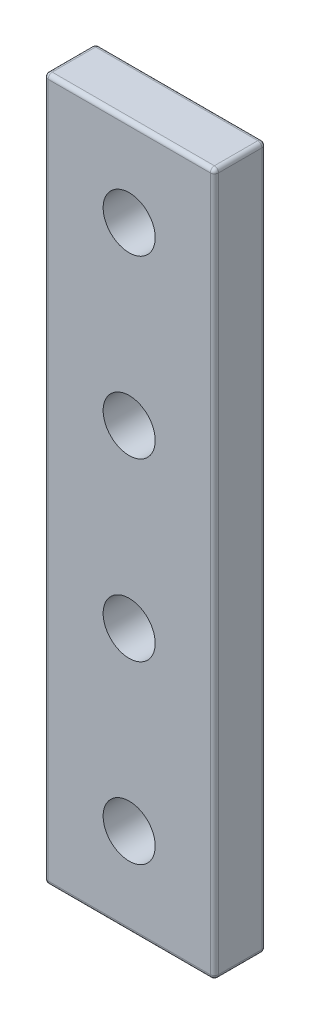
ISO-10303-21;
HEADER;
FILE_DESCRIPTION(('STEP AP214'),'2;1');
FILE_NAME('part.step','',(''),(''),'','','');
FILE_SCHEMA(('AUTOMOTIVE_DESIGN { 1 0 10303 214 1 1 1 1 }'));
ENDSEC;
DATA;
#1=APPLICATION_CONTEXT('core data for automotive mechanical design processes');
#2=APPLICATION_PROTOCOL_DEFINITION('international standard','automotive_design',2000,#1);
#3=PRODUCT_CONTEXT('',#1,'mechanical');
#4=PRODUCT('Part','Part','',(#3));
#5=PRODUCT_RELATED_PRODUCT_CATEGORY('part','',(#4));
#6=PRODUCT_DEFINITION_FORMATION('','',#4);
#7=PRODUCT_DEFINITION_CONTEXT('part definition',#1,'design');
#8=PRODUCT_DEFINITION('design','',#6,#7);
#9=PRODUCT_DEFINITION_SHAPE('','',#8);
#10=(LENGTH_UNIT() NAMED_UNIT(*) SI_UNIT(.MILLI.,.METRE.));
#11=(NAMED_UNIT(*) PLANE_ANGLE_UNIT() SI_UNIT($,.RADIAN.));
#12=(NAMED_UNIT(*) SI_UNIT($,.STERADIAN.) SOLID_ANGLE_UNIT());
#13=UNCERTAINTY_MEASURE_WITH_UNIT(LENGTH_MEASURE(1.E-05),#10,'distance_accuracy_value','');
#14=(GEOMETRIC_REPRESENTATION_CONTEXT(3) GLOBAL_UNCERTAINTY_ASSIGNED_CONTEXT((#13)) GLOBAL_UNIT_ASSIGNED_CONTEXT((#10,
#11,#12)) REPRESENTATION_CONTEXT('',''));
#15=CARTESIAN_POINT('',(0.,0.,0.));
#16=DIRECTION('',(0.,0.,1.));
#17=DIRECTION('',(1.,0.,0.));
#18=AXIS2_PLACEMENT_3D('',#15,#16,#17);
#19=CARTESIAN_POINT('',(5.04802479571278E-11,-1875.57831358665,5.));
#20=DIRECTION('',(0.,1.,0.));
#21=DIRECTION('',(-1.,0.,0.));
#22=AXIS2_PLACEMENT_3D('',#19,#20,#21);
#23=PLANE('',#22);
#24=DIRECTION('',(0.,0.,-1.));
#25=VECTOR('',#24,1.);
#26=CARTESIAN_POINT('',(766.357494380179,-1875.57831358663,0.));
#27=LINE('',#26,#25);
#28=CARTESIAN_POINT('',(766.357494380179,-1875.57831358663,4.6));
#29=VERTEX_POINT('',#28);
#30=CARTESIAN_POINT('',(766.357494380179,-1875.57831358663,0.4));
#31=VERTEX_POINT('',#30);
#32=EDGE_CURVE('E194',#29,#31,#27,.T.);
#33=ORIENTED_EDGE('',*,*,#32,.T.);
#34=DIRECTION('',(1.,0.,0.));
#35=VECTOR('',#34,1.);
#36=CARTESIAN_POINT('',(750.657494380179,-1875.57831358663,0.4));
#37=LINE('',#36,#35);
#38=CARTESIAN_POINT('',(750.657494380179,-1875.57831358663,0.4));
#39=VERTEX_POINT('',#38);
#40=EDGE_CURVE('E11',#31,#39,#37,.F.);
#41=ORIENTED_EDGE('',*,*,#40,.T.);
#42=DIRECTION('',(0.,0.,-1.));
#43=VECTOR('',#42,1.);
#44=CARTESIAN_POINT('',(750.657494380179,-1875.57831358663,5.));
#45=LINE('',#44,#43);
#46=CARTESIAN_POINT('',(750.657494380179,-1875.57831358663,4.6));
#47=VERTEX_POINT('',#46);
#48=EDGE_CURVE('E183',#39,#47,#45,.F.);
#49=ORIENTED_EDGE('',*,*,#48,.T.);
#50=DIRECTION('',(1.,0.,0.));
#51=VECTOR('',#50,1.);
#52=CARTESIAN_POINT('',(5.04802479571278E-11,-1875.57831358665,4.6));
#53=LINE('',#52,#51);
#54=EDGE_CURVE('E197',#47,#29,#53,.T.);
#55=ORIENTED_EDGE('',*,*,#54,.T.);
#56=EDGE_LOOP('',(#33,#41,#49,#55));
#57=FACE_BOUND('',#56,.T.);
#58=ADVANCED_FACE('F49',(#57),#23,.T.);
#59=CARTESIAN_POINT('',(750.257494380179,0.,5.));
#60=DIRECTION('',(-1.,0.,0.));
#61=DIRECTION('',(0.,0.,1.));
#62=AXIS2_PLACEMENT_3D('',#59,#60,#61);
#63=PLANE('',#62);
#64=DIRECTION('',(0.,1.,0.));
#65=VECTOR('',#64,1.);
#66=CARTESIAN_POINT('',(750.257494380179,-1943.57831358663,0.4));
#67=LINE('',#66,#65);
#68=CARTESIAN_POINT('',(750.257494380179,-1875.97831358663,0.4));
#69=VERTEX_POINT('',#68);
#70=CARTESIAN_POINT('',(750.257494380179,-1943.17831358663,0.4));
#71=VERTEX_POINT('',#70);
#72=EDGE_CURVE('E168',#69,#71,#67,.F.);
#73=ORIENTED_EDGE('',*,*,#72,.T.);
#74=DIRECTION('',(0.,0.,-1.));
#75=VECTOR('',#74,1.);
#76=CARTESIAN_POINT('',(750.257494380179,-1943.17831358663,5.));
#77=LINE('',#76,#75);
#78=CARTESIAN_POINT('',(750.257494380179,-1943.17831358663,4.6));
#79=VERTEX_POINT('',#78);
#80=EDGE_CURVE('E166',#71,#79,#77,.F.);
#81=ORIENTED_EDGE('',*,*,#80,.T.);
#82=DIRECTION('',(0.,1.,0.));
#83=VECTOR('',#82,1.);
#84=CARTESIAN_POINT('',(750.257494380179,0.,4.6));
#85=LINE('',#84,#83);
#86=CARTESIAN_POINT('',(750.257494380179,-1875.97831358663,4.6));
#87=VERTEX_POINT('',#86);
#88=EDGE_CURVE('E145',#79,#87,#85,.T.);
#89=ORIENTED_EDGE('',*,*,#88,.T.);
#90=DIRECTION('',(0.,0.,-1.));
#91=VECTOR('',#90,1.);
#92=CARTESIAN_POINT('',(750.257494380179,-1875.97831358663,5.));
#93=LINE('',#92,#91);
#94=EDGE_CURVE('E163',#87,#69,#93,.T.);
#95=ORIENTED_EDGE('',*,*,#94,.T.);
#96=EDGE_LOOP('',(#73,#81,#89,#95));
#97=FACE_BOUND('',#96,.T.);
#98=ADVANCED_FACE('F162',(#97),#63,.T.);
#99=CARTESIAN_POINT('',(2.61552168958306E-11,-1943.57831358664,5.));
#100=DIRECTION('',(0.,1.,0.));
#101=DIRECTION('',(-1.,0.,0.));
#102=AXIS2_PLACEMENT_3D('',#99,#100,#101);
#103=PLANE('',#102);
#104=DIRECTION('',(0.,0.,-1.));
#105=VECTOR('',#104,1.);
#106=CARTESIAN_POINT('',(750.657494380179,-1943.57831358663,0.));
#107=LINE('',#106,#105);
#108=CARTESIAN_POINT('',(750.657494380179,-1943.57831358663,4.6));
#109=VERTEX_POINT('',#108);
#110=CARTESIAN_POINT('',(750.657494380179,-1943.57831358663,0.4));
#111=VERTEX_POINT('',#110);
#112=EDGE_CURVE('E188',#109,#111,#107,.T.);
#113=ORIENTED_EDGE('',*,*,#112,.T.);
#114=DIRECTION('',(1.,0.,0.));
#115=VECTOR('',#114,1.);
#116=CARTESIAN_POINT('',(2.61552168958306E-11,-1943.57831358664,0.4));
#117=LINE('',#116,#115);
#118=CARTESIAN_POINT('',(766.357494380179,-1943.57831358663,0.4));
#119=VERTEX_POINT('',#118);
#120=EDGE_CURVE('E289',#111,#119,#117,.T.);
#121=ORIENTED_EDGE('',*,*,#120,.T.);
#122=DIRECTION('',(0.,0.,-1.));
#123=VECTOR('',#122,1.);
#124=CARTESIAN_POINT('',(766.357494380179,-1943.57831358663,5.));
#125=LINE('',#124,#123);
#126=CARTESIAN_POINT('',(766.357494380179,-1943.57831358663,4.6));
#127=VERTEX_POINT('',#126);
#128=EDGE_CURVE('E209',#119,#127,#125,.F.);
#129=ORIENTED_EDGE('',*,*,#128,.T.);
#130=DIRECTION('',(1.,0.,0.));
#131=VECTOR('',#130,1.);
#132=CARTESIAN_POINT('',(750.657494380179,-1943.57831358663,4.6));
#133=LINE('',#132,#131);
#134=EDGE_CURVE('E212',#127,#109,#133,.F.);
#135=ORIENTED_EDGE('',*,*,#134,.T.);
#136=EDGE_LOOP('',(#113,#121,#129,#135));
#137=FACE_BOUND('',#136,.T.);
#138=ADVANCED_FACE('F380',(#137),#103,.F.);
#139=CARTESIAN_POINT('',(758.507494380179,-1935.07831358663,5.));
#140=DIRECTION('',(0.,0.,-1.));
#141=DIRECTION('',(-1.,0.,0.));
#142=AXIS2_PLACEMENT_3D('',#139,#140,#141);
#143=CYLINDRICAL_SURFACE('',#142,2.5200000000001);
#144=CARTESIAN_POINT('',(758.507494380179,-1935.07831358663,5.));
#145=DIRECTION('',(0.,0.,1.));
#146=DIRECTION('',(1.,0.,0.));
#147=AXIS2_PLACEMENT_3D('',#144,#145,#146);
#148=CIRCLE('',#147,2.5200000000001);
#149=CARTESIAN_POINT('',(761.027494380179,-1935.07831358663,5.));
#150=VERTEX_POINT('',#149);
#151=EDGE_CURVE('E365',#150,#150,#148,.T.);
#152=ORIENTED_EDGE('',*,*,#151,.T.);
#153=EDGE_LOOP('',(#152));
#154=FACE_BOUND('',#153,.T.);
#155=CARTESIAN_POINT('',(758.507494380179,-1935.07831358663,0.));
#156=DIRECTION('',(0.,0.,1.));
#157=DIRECTION('',(1.,0.,0.));
#158=AXIS2_PLACEMENT_3D('',#155,#156,#157);
#159=CIRCLE('',#158,2.5200000000001);
#160=CARTESIAN_POINT('',(761.027494380179,-1935.07831358663,0.));
#161=VERTEX_POINT('',#160);
#162=EDGE_CURVE('E680',#161,#161,#159,.T.);
#163=ORIENTED_EDGE('',*,*,#162,.F.);
#164=EDGE_LOOP('',(#163));
#165=FACE_BOUND('',#164,.T.);
#166=ADVANCED_FACE('F612',(#154,#165),#143,.F.);
#167=CARTESIAN_POINT('',(758.507494380179,-1901.07831358663,5.));
#168=DIRECTION('',(0.,0.,-1.));
#169=DIRECTION('',(-1.,0.,0.));
#170=AXIS2_PLACEMENT_3D('',#167,#168,#169);
#171=CYLINDRICAL_SURFACE('',#170,2.5200000000001);
#172=CARTESIAN_POINT('',(758.507494380179,-1901.07831358663,5.));
#173=DIRECTION('',(0.,0.,1.));
#174=DIRECTION('',(1.,0.,0.));
#175=AXIS2_PLACEMENT_3D('',#172,#173,#174);
#176=CIRCLE('',#175,2.5200000000001);
#177=CARTESIAN_POINT('',(761.027494380179,-1901.07831358663,5.));
#178=VERTEX_POINT('',#177);
#179=EDGE_CURVE('E696',#178,#178,#176,.F.);
#180=ORIENTED_EDGE('',*,*,#179,.F.);
#181=EDGE_LOOP('',(#180));
#182=FACE_BOUND('',#181,.T.);
#183=CARTESIAN_POINT('',(758.507494380179,-1901.07831358663,0.));
#184=DIRECTION('',(0.,0.,1.));
#185=DIRECTION('',(1.,0.,0.));
#186=AXIS2_PLACEMENT_3D('',#183,#184,#185);
#187=CIRCLE('',#186,2.5200000000001);
#188=CARTESIAN_POINT('',(761.027494380179,-1901.07831358663,0.));
#189=VERTEX_POINT('',#188);
#190=EDGE_CURVE('E683',#189,#189,#187,.F.);
#191=ORIENTED_EDGE('',*,*,#190,.T.);
#192=EDGE_LOOP('',(#191));
#193=FACE_BOUND('',#192,.T.);
#194=ADVANCED_FACE('F603',(#182,#193),#171,.F.);
#195=CARTESIAN_POINT('',(758.507494380179,-1884.07831358663,5.));
#196=DIRECTION('',(0.,0.,-1.));
#197=DIRECTION('',(-1.,0.,0.));
#198=AXIS2_PLACEMENT_3D('',#195,#196,#197);
#199=CYLINDRICAL_SURFACE('',#198,2.5200000000001);
#200=CARTESIAN_POINT('',(758.507494380179,-1884.07831358663,5.));
#201=DIRECTION('',(0.,0.,1.));
#202=DIRECTION('',(1.,0.,0.));
#203=AXIS2_PLACEMENT_3D('',#200,#201,#202);
#204=CIRCLE('',#203,2.5200000000001);
#205=CARTESIAN_POINT('',(761.027494380179,-1884.07831358663,5.));
#206=VERTEX_POINT('',#205);
#207=EDGE_CURVE('E687',#206,#206,#204,.F.);
#208=ORIENTED_EDGE('',*,*,#207,.F.);
#209=EDGE_LOOP('',(#208));
#210=FACE_BOUND('',#209,.T.);
#211=CARTESIAN_POINT('',(758.507494380179,-1884.07831358663,0.));
#212=DIRECTION('',(0.,0.,1.));
#213=DIRECTION('',(1.,0.,0.));
#214=AXIS2_PLACEMENT_3D('',#211,#212,#213);
#215=CIRCLE('',#214,2.5200000000001);
#216=CARTESIAN_POINT('',(761.027494380179,-1884.07831358663,0.));
#217=VERTEX_POINT('',#216);
#218=EDGE_CURVE('E265',#217,#217,#215,.F.);
#219=ORIENTED_EDGE('',*,*,#218,.T.);
#220=EDGE_LOOP('',(#219));
#221=FACE_BOUND('',#220,.T.);
#222=ADVANCED_FACE('F595',(#210,#221),#199,.F.);
#223=CARTESIAN_POINT('',(766.757494380179,0.,5.));
#224=DIRECTION('',(-1.,0.,0.));
#225=DIRECTION('',(0.,0.,1.));
#226=AXIS2_PLACEMENT_3D('',#223,#224,#225);
#227=PLANE('',#226);
#228=DIRECTION('',(0.,0.,-1.));
#229=VECTOR('',#228,1.);
#230=CARTESIAN_POINT('',(766.757494380179,-1875.97831358663,5.));
#231=LINE('',#230,#229);
#232=CARTESIAN_POINT('',(766.757494380179,-1875.97831358663,0.4));
#233=VERTEX_POINT('',#232);
#234=CARTESIAN_POINT('',(766.757494380179,-1875.97831358663,4.6));
#235=VERTEX_POINT('',#234);
#236=EDGE_CURVE('E223',#233,#235,#231,.F.);
#237=ORIENTED_EDGE('',*,*,#236,.T.);
#238=DIRECTION('',(0.,1.,0.));
#239=VECTOR('',#238,1.);
#240=CARTESIAN_POINT('',(766.757494380179,-1943.57831358663,4.6));
#241=LINE('',#240,#239);
#242=CARTESIAN_POINT('',(766.757494380179,-1943.17831358663,4.6));
#243=VERTEX_POINT('',#242);
#244=EDGE_CURVE('E226',#235,#243,#241,.F.);
#245=ORIENTED_EDGE('',*,*,#244,.T.);
#246=DIRECTION('',(0.,0.,-1.));
#247=VECTOR('',#246,1.);
#248=CARTESIAN_POINT('',(766.757494380179,-1943.17831358663,5.));
#249=LINE('',#248,#247);
#250=CARTESIAN_POINT('',(766.757494380179,-1943.17831358663,0.4));
#251=VERTEX_POINT('',#250);
#252=EDGE_CURVE('E215',#243,#251,#249,.T.);
#253=ORIENTED_EDGE('',*,*,#252,.T.);
#254=DIRECTION('',(0.,1.,0.));
#255=VECTOR('',#254,1.);
#256=CARTESIAN_POINT('',(766.757494380179,0.,0.4));
#257=LINE('',#256,#255);
#258=EDGE_CURVE('E219',#251,#233,#257,.T.);
#259=ORIENTED_EDGE('',*,*,#258,.T.);
#260=EDGE_LOOP('',(#237,#245,#253,#259));
#261=FACE_BOUND('',#260,.T.);
#262=ADVANCED_FACE('F322',(#261),#227,.F.);
#263=CARTESIAN_POINT('',(758.507494380179,-1918.07831358663,5.));
#264=DIRECTION('',(0.,0.,-1.));
#265=DIRECTION('',(-1.,0.,0.));
#266=AXIS2_PLACEMENT_3D('',#263,#264,#265);
#267=CYLINDRICAL_SURFACE('',#266,2.5200000000001);
#268=CARTESIAN_POINT('',(758.507494380179,-1918.07831358663,5.));
#269=DIRECTION('',(0.,0.,1.));
#270=DIRECTION('',(1.,0.,0.));
#271=AXIS2_PLACEMENT_3D('',#268,#269,#270);
#272=CIRCLE('',#271,2.5200000000001);
#273=CARTESIAN_POINT('',(761.027494380179,-1918.07831358663,5.));
#274=VERTEX_POINT('',#273);
#275=EDGE_CURVE('E361',#274,#274,#272,.T.);
#276=ORIENTED_EDGE('',*,*,#275,.T.);
#277=EDGE_LOOP('',(#276));
#278=FACE_BOUND('',#277,.T.);
#279=CARTESIAN_POINT('',(758.507494380179,-1918.07831358663,0.));
#280=DIRECTION('',(0.,0.,1.));
#281=DIRECTION('',(1.,0.,0.));
#282=AXIS2_PLACEMENT_3D('',#279,#280,#281);
#283=CIRCLE('',#282,2.5200000000001);
#284=CARTESIAN_POINT('',(761.027494380179,-1918.07831358663,0.));
#285=VERTEX_POINT('',#284);
#286=EDGE_CURVE('E368',#285,#285,#283,.T.);
#287=ORIENTED_EDGE('',*,*,#286,.F.);
#288=EDGE_LOOP('',(#287));
#289=FACE_BOUND('',#288,.T.);
#290=ADVANCED_FACE('F578',(#278,#289),#267,.F.);
#291=CARTESIAN_POINT('',(0.,0.,5.));
#292=DIRECTION('',(0.,0.,1.));
#293=DIRECTION('',(1.,0.,0.));
#294=AXIS2_PLACEMENT_3D('',#291,#292,#293);
#295=PLANE('',#294);
#296=DIRECTION('',(0.,1.,0.));
#297=VECTOR('',#296,1.);
#298=CARTESIAN_POINT('',(766.357494380179,-1875.57831358663,5.));
#299=LINE('',#298,#297);
#300=CARTESIAN_POINT('',(766.357494380179,-1943.17831358663,5.));
#301=VERTEX_POINT('',#300);
#302=CARTESIAN_POINT('',(766.357494380179,-1875.97831358663,5.));
#303=VERTEX_POINT('',#302);
#304=EDGE_CURVE('E200',#301,#303,#299,.T.);
#305=ORIENTED_EDGE('',*,*,#304,.T.);
#306=DIRECTION('',(1.,0.,0.));
#307=VECTOR('',#306,1.);
#308=CARTESIAN_POINT('',(5.04910137561545E-11,-1875.97831358665,5.));
#309=LINE('',#308,#307);
#310=CARTESIAN_POINT('',(750.657494380179,-1875.97831358663,5.));
#311=VERTEX_POINT('',#310);
#312=EDGE_CURVE('E206',#303,#311,#309,.F.);
#313=ORIENTED_EDGE('',*,*,#312,.T.);
#314=DIRECTION('',(0.,1.,0.));
#315=VECTOR('',#314,1.);
#316=CARTESIAN_POINT('',(750.657494380179,0.,5.));
#317=LINE('',#316,#315);
#318=CARTESIAN_POINT('',(750.657494380179,-1943.17831358663,5.));
#319=VERTEX_POINT('',#318);
#320=EDGE_CURVE('E148',#311,#319,#317,.F.);
#321=ORIENTED_EDGE('',*,*,#320,.T.);
#322=DIRECTION('',(1.,0.,0.));
#323=VECTOR('',#322,1.);
#324=CARTESIAN_POINT('',(766.757494380179,-1943.17831358663,5.));
#325=LINE('',#324,#323);
#326=EDGE_CURVE('E203',#319,#301,#325,.T.);
#327=ORIENTED_EDGE('',*,*,#326,.T.);
#328=EDGE_LOOP('',(#305,#313,#321,#327));
#329=FACE_BOUND('',#328,.T.);
#330=ORIENTED_EDGE('',*,*,#207,.T.);
#331=EDGE_LOOP('',(#330));
#332=FACE_BOUND('',#331,.T.);
#333=ORIENTED_EDGE('',*,*,#179,.T.);
#334=EDGE_LOOP('',(#333));
#335=FACE_BOUND('',#334,.T.);
#336=ORIENTED_EDGE('',*,*,#151,.F.);
#337=EDGE_LOOP('',(#336));
#338=FACE_BOUND('',#337,.T.);
#339=ORIENTED_EDGE('',*,*,#275,.F.);
#340=EDGE_LOOP('',(#339));
#341=FACE_BOUND('',#340,.T.);
#342=ADVANCED_FACE('F392',(#329,#332,#335,#338,#341),#295,.T.);
#343=CARTESIAN_POINT('',(0.,0.,0.));
#344=DIRECTION('',(0.,0.,1.));
#345=DIRECTION('',(1.,0.,0.));
#346=AXIS2_PLACEMENT_3D('',#343,#344,#345);
#347=PLANE('',#346);
#348=DIRECTION('',(0.,1.,0.));
#349=VECTOR('',#348,1.);
#350=CARTESIAN_POINT('',(766.357494380179,0.,0.));
#351=LINE('',#350,#349);
#352=CARTESIAN_POINT('',(766.357494380179,-1875.97831358663,0.));
#353=VERTEX_POINT('',#352);
#354=CARTESIAN_POINT('',(766.357494380179,-1943.17831358663,0.));
#355=VERTEX_POINT('',#354);
#356=EDGE_CURVE('E230',#353,#355,#351,.F.);
#357=ORIENTED_EDGE('',*,*,#356,.T.);
#358=DIRECTION('',(1.,0.,0.));
#359=VECTOR('',#358,1.);
#360=CARTESIAN_POINT('',(2.61498339963172E-11,-1943.17831358664,0.));
#361=LINE('',#360,#359);
#362=CARTESIAN_POINT('',(750.657494380179,-1943.17831358663,0.));
#363=VERTEX_POINT('',#362);
#364=EDGE_CURVE('E59',#355,#363,#361,.F.);
#365=ORIENTED_EDGE('',*,*,#364,.T.);
#366=DIRECTION('',(0.,1.,0.));
#367=VECTOR('',#366,1.);
#368=CARTESIAN_POINT('',(750.657494380179,-1875.57831358663,0.));
#369=LINE('',#368,#367);
#370=CARTESIAN_POINT('',(750.657494380179,-1875.97831358663,0.));
#371=VERTEX_POINT('',#370);
#372=EDGE_CURVE('E177',#363,#371,#369,.T.);
#373=ORIENTED_EDGE('',*,*,#372,.T.);
#374=DIRECTION('',(1.,0.,0.));
#375=VECTOR('',#374,1.);
#376=CARTESIAN_POINT('',(766.357494380179,-1875.97831358663,0.));
#377=LINE('',#376,#375);
#378=EDGE_CURVE('E292',#371,#353,#377,.T.);
#379=ORIENTED_EDGE('',*,*,#378,.T.);
#380=EDGE_LOOP('',(#357,#365,#373,#379));
#381=FACE_BOUND('',#380,.T.);
#382=ORIENTED_EDGE('',*,*,#218,.F.);
#383=EDGE_LOOP('',(#382));
#384=FACE_BOUND('',#383,.T.);
#385=ORIENTED_EDGE('',*,*,#190,.F.);
#386=EDGE_LOOP('',(#385));
#387=FACE_BOUND('',#386,.T.);
#388=ORIENTED_EDGE('',*,*,#162,.T.);
#389=EDGE_LOOP('',(#388));
#390=FACE_BOUND('',#389,.T.);
#391=ORIENTED_EDGE('',*,*,#286,.T.);
#392=EDGE_LOOP('',(#391));
#393=FACE_BOUND('',#392,.T.);
#394=ADVANCED_FACE('F356',(#381,#384,#387,#390,#393),#347,.F.);
#395=CARTESIAN_POINT('',(750.657494380179,0.,4.6));
#396=DIRECTION('',(0.,1.,0.));
#397=DIRECTION('',(0.,0.,1.));
#398=AXIS2_PLACEMENT_3D('',#395,#396,#397);
#399=CYLINDRICAL_SURFACE('',#398,0.4);
#400=ORIENTED_EDGE('',*,*,#320,.F.);
#401=CARTESIAN_POINT('',(750.657494380179,-1875.97831358663,4.6));
#402=DIRECTION('',(0.,1.,0.));
#403=DIRECTION('',(0.,0.,1.));
#404=AXIS2_PLACEMENT_3D('',#401,#402,#403);
#405=CIRCLE('',#404,0.4);
#406=EDGE_CURVE('E142',#311,#87,#405,.F.);
#407=ORIENTED_EDGE('',*,*,#406,.T.);
#408=ORIENTED_EDGE('',*,*,#88,.F.);
#409=CARTESIAN_POINT('',(750.657494380179,-1943.17831358663,4.6));
#410=DIRECTION('',(0.,1.,0.));
#411=DIRECTION('',(0.,0.,1.));
#412=AXIS2_PLACEMENT_3D('',#409,#410,#411);
#413=CIRCLE('',#412,0.4);
#414=EDGE_CURVE('E155',#79,#319,#413,.T.);
#415=ORIENTED_EDGE('',*,*,#414,.T.);
#416=EDGE_LOOP('',(#400,#407,#408,#415));
#417=FACE_BOUND('',#416,.T.);
#418=ADVANCED_FACE('F144',(#417),#399,.T.);
#419=CARTESIAN_POINT('',(750.657494380179,-1943.17831358663,5.));
#420=DIRECTION('',(0.,0.,1.));
#421=DIRECTION('',(1.,0.,0.));
#422=AXIS2_PLACEMENT_3D('',#419,#420,#421);
#423=CYLINDRICAL_SURFACE('',#422,0.4);
#424=ORIENTED_EDGE('',*,*,#80,.F.);
#425=CARTESIAN_POINT('',(750.657494380179,-1943.17831358663,0.4));
#426=DIRECTION('',(0.,0.,1.));
#427=DIRECTION('',(1.,0.,0.));
#428=AXIS2_PLACEMENT_3D('',#425,#426,#427);
#429=CIRCLE('',#428,0.4);
#430=EDGE_CURVE('E273',#71,#111,#429,.T.);
#431=ORIENTED_EDGE('',*,*,#430,.T.);
#432=ORIENTED_EDGE('',*,*,#112,.F.);
#433=CARTESIAN_POINT('',(750.657494380179,-1943.17831358663,4.6));
#434=DIRECTION('',(0.,0.,1.));
#435=DIRECTION('',(1.,0.,0.));
#436=AXIS2_PLACEMENT_3D('',#433,#434,#435);
#437=CIRCLE('',#436,0.4);
#438=EDGE_CURVE('E154',#109,#79,#437,.F.);
#439=ORIENTED_EDGE('',*,*,#438,.T.);
#440=EDGE_LOOP('',(#424,#431,#432,#439));
#441=FACE_BOUND('',#440,.T.);
#442=ADVANCED_FACE('F384',(#441),#423,.T.);
#443=CARTESIAN_POINT('',(750.657494380179,-1875.97831358663,5.));
#444=DIRECTION('',(0.,0.,-1.));
#445=DIRECTION('',(-1.,0.,0.));
#446=AXIS2_PLACEMENT_3D('',#443,#444,#445);
#447=CYLINDRICAL_SURFACE('',#446,0.4);
#448=ORIENTED_EDGE('',*,*,#48,.F.);
#449=CARTESIAN_POINT('',(750.657494380179,-1875.97831358663,0.4));
#450=DIRECTION('',(0.,0.,-1.));
#451=DIRECTION('',(-1.,0.,0.));
#452=AXIS2_PLACEMENT_3D('',#449,#450,#451);
#453=CIRCLE('',#452,0.4);
#454=EDGE_CURVE('E175',#39,#69,#453,.F.);
#455=ORIENTED_EDGE('',*,*,#454,.T.);
#456=ORIENTED_EDGE('',*,*,#94,.F.);
#457=CARTESIAN_POINT('',(750.657494380179,-1875.97831358663,4.6));
#458=DIRECTION('',(0.,0.,-1.));
#459=DIRECTION('',(-1.,0.,0.));
#460=AXIS2_PLACEMENT_3D('',#457,#458,#459);
#461=CIRCLE('',#460,0.4);
#462=EDGE_CURVE('E173',#87,#47,#461,.T.);
#463=ORIENTED_EDGE('',*,*,#462,.T.);
#464=EDGE_LOOP('',(#448,#455,#456,#463));
#465=FACE_BOUND('',#464,.T.);
#466=ADVANCED_FACE('F172',(#465),#447,.T.);
#467=CARTESIAN_POINT('',(750.657494380179,0.,0.4));
#468=DIRECTION('',(0.,-1.,0.));
#469=DIRECTION('',(0.,0.,-1.));
#470=AXIS2_PLACEMENT_3D('',#467,#468,#469);
#471=CYLINDRICAL_SURFACE('',#470,0.4);
#472=ORIENTED_EDGE('',*,*,#372,.F.);
#473=CARTESIAN_POINT('',(750.657494380179,-1943.17831358663,0.4));
#474=DIRECTION('',(0.,-1.,0.));
#475=DIRECTION('',(0.,0.,-1.));
#476=AXIS2_PLACEMENT_3D('',#473,#474,#475);
#477=CIRCLE('',#476,0.4);
#478=EDGE_CURVE('E269',#363,#71,#477,.F.);
#479=ORIENTED_EDGE('',*,*,#478,.T.);
#480=ORIENTED_EDGE('',*,*,#72,.F.);
#481=CARTESIAN_POINT('',(750.657494380179,-1875.97831358663,0.4));
#482=DIRECTION('',(0.,-1.,0.));
#483=DIRECTION('',(0.,0.,-1.));
#484=AXIS2_PLACEMENT_3D('',#481,#482,#483);
#485=CIRCLE('',#484,0.4);
#486=EDGE_CURVE('E234',#69,#371,#485,.T.);
#487=ORIENTED_EDGE('',*,*,#486,.T.);
#488=EDGE_LOOP('',(#472,#479,#480,#487));
#489=FACE_BOUND('',#488,.T.);
#490=ADVANCED_FACE('F359',(#489),#471,.T.);
#491=CARTESIAN_POINT('',(750.657494380179,-1943.17831358663,4.6));
#492=DIRECTION('',(0.,0.,1.));
#493=DIRECTION('',(1.,0.,0.));
#494=AXIS2_PLACEMENT_3D('',#491,#492,#493);
#495=SPHERICAL_SURFACE('',#494,0.4);
#496=ORIENTED_EDGE('',*,*,#414,.F.);
#497=ORIENTED_EDGE('',*,*,#438,.F.);
#498=CARTESIAN_POINT('',(750.657494380179,-1943.17831358663,4.6));
#499=DIRECTION('',(1.,0.,0.));
#500=DIRECTION('',(0.,0.,-1.));
#501=AXIS2_PLACEMENT_3D('',#498,#499,#500);
#502=CIRCLE('',#501,0.4);
#503=EDGE_CURVE('E261',#319,#109,#502,.T.);
#504=ORIENTED_EDGE('',*,*,#503,.F.);
#505=EDGE_LOOP('',(#496,#497,#504));
#506=FACE_BOUND('',#505,.T.);
#507=ADVANCED_FACE('F387',(#506),#495,.T.);
#508=CARTESIAN_POINT('',(766.357494380179,-1943.17831358663,5.));
#509=DIRECTION('',(0.,0.,-1.));
#510=DIRECTION('',(-1.,0.,0.));
#511=AXIS2_PLACEMENT_3D('',#508,#509,#510);
#512=CYLINDRICAL_SURFACE('',#511,0.4);
#513=ORIENTED_EDGE('',*,*,#128,.F.);
#514=CARTESIAN_POINT('',(766.357494380179,-1943.17831358663,0.4));
#515=DIRECTION('',(0.,0.,-1.));
#516=DIRECTION('',(-1.,0.,0.));
#517=AXIS2_PLACEMENT_3D('',#514,#515,#516);
#518=CIRCLE('',#517,0.4);
#519=EDGE_CURVE('E282',#119,#251,#518,.F.);
#520=ORIENTED_EDGE('',*,*,#519,.T.);
#521=ORIENTED_EDGE('',*,*,#252,.F.);
#522=CARTESIAN_POINT('',(766.357494380179,-1943.17831358663,4.6));
#523=DIRECTION('',(0.,0.,1.));
#524=DIRECTION('',(1.,0.,0.));
#525=AXIS2_PLACEMENT_3D('',#522,#523,#524);
#526=CIRCLE('',#525,0.4);
#527=EDGE_CURVE('E257',#127,#243,#526,.T.);
#528=ORIENTED_EDGE('',*,*,#527,.F.);
#529=EDGE_LOOP('',(#513,#520,#521,#528));
#530=FACE_BOUND('',#529,.T.);
#531=ADVANCED_FACE('F342',(#530),#512,.T.);
#532=CARTESIAN_POINT('',(2.61498339963172E-11,-1943.17831358664,4.6));
#533=DIRECTION('',(-1.,0.,0.));
#534=DIRECTION('',(0.,-1.,0.));
#535=AXIS2_PLACEMENT_3D('',#532,#533,#534);
#536=CYLINDRICAL_SURFACE('',#535,0.4);
#537=ORIENTED_EDGE('',*,*,#503,.T.);
#538=ORIENTED_EDGE('',*,*,#134,.F.);
#539=CARTESIAN_POINT('',(766.357494380179,-1943.17831358663,4.6));
#540=DIRECTION('',(1.,0.,0.));
#541=DIRECTION('',(0.,0.,-1.));
#542=AXIS2_PLACEMENT_3D('',#539,#540,#541);
#543=CIRCLE('',#542,0.4);
#544=EDGE_CURVE('E253',#301,#127,#543,.T.);
#545=ORIENTED_EDGE('',*,*,#544,.F.);
#546=ORIENTED_EDGE('',*,*,#326,.F.);
#547=EDGE_LOOP('',(#537,#538,#545,#546));
#548=FACE_BOUND('',#547,.T.);
#549=ADVANCED_FACE('F390',(#548),#536,.T.);
#550=CARTESIAN_POINT('',(766.357494380179,0.,0.4));
#551=DIRECTION('',(0.,1.,0.));
#552=DIRECTION('',(0.,0.,1.));
#553=AXIS2_PLACEMENT_3D('',#550,#551,#552);
#554=CYLINDRICAL_SURFACE('',#553,0.4);
#555=ORIENTED_EDGE('',*,*,#258,.F.);
#556=CARTESIAN_POINT('',(766.357494380179,-1943.17831358663,0.4));
#557=DIRECTION('',(0.,1.,0.));
#558=DIRECTION('',(0.,0.,1.));
#559=AXIS2_PLACEMENT_3D('',#556,#557,#558);
#560=CIRCLE('',#559,0.4);
#561=EDGE_CURVE('E279',#251,#355,#560,.T.);
#562=ORIENTED_EDGE('',*,*,#561,.T.);
#563=ORIENTED_EDGE('',*,*,#356,.F.);
#564=CARTESIAN_POINT('',(766.357494380179,-1875.97831358663,0.4));
#565=DIRECTION('',(0.,1.,0.));
#566=DIRECTION('',(0.,0.,1.));
#567=AXIS2_PLACEMENT_3D('',#564,#565,#566);
#568=CIRCLE('',#567,0.4);
#569=EDGE_CURVE('E276',#353,#233,#568,.F.);
#570=ORIENTED_EDGE('',*,*,#569,.T.);
#571=EDGE_LOOP('',(#555,#562,#563,#570));
#572=FACE_BOUND('',#571,.T.);
#573=ADVANCED_FACE('F319',(#572),#554,.T.);
#574=CARTESIAN_POINT('',(766.357494380179,-1943.17831358663,4.6));
#575=DIRECTION('',(0.,-1.,0.));
#576=DIRECTION('',(0.,0.,-1.));
#577=AXIS2_PLACEMENT_3D('',#574,#575,#576);
#578=SPHERICAL_SURFACE('',#577,0.4);
#579=ORIENTED_EDGE('',*,*,#544,.T.);
#580=ORIENTED_EDGE('',*,*,#527,.T.);
#581=CARTESIAN_POINT('',(766.357494380179,-1943.17831358663,4.6));
#582=DIRECTION('',(0.,-1.,0.));
#583=DIRECTION('',(0.,0.,-1.));
#584=AXIS2_PLACEMENT_3D('',#581,#582,#583);
#585=CIRCLE('',#584,0.4);
#586=EDGE_CURVE('E250',#301,#243,#585,.F.);
#587=ORIENTED_EDGE('',*,*,#586,.F.);
#588=EDGE_LOOP('',(#579,#580,#587));
#589=FACE_BOUND('',#588,.T.);
#590=ADVANCED_FACE('F338',(#589),#578,.T.);
#591=CARTESIAN_POINT('',(766.357494380179,-1875.97831358663,5.));
#592=DIRECTION('',(0.,0.,1.));
#593=DIRECTION('',(1.,0.,0.));
#594=AXIS2_PLACEMENT_3D('',#591,#592,#593);
#595=CYLINDRICAL_SURFACE('',#594,0.4);
#596=ORIENTED_EDGE('',*,*,#236,.F.);
#597=CARTESIAN_POINT('',(766.357494380179,-1875.97831358663,0.4));
#598=DIRECTION('',(0.,0.,1.));
#599=DIRECTION('',(1.,0.,0.));
#600=AXIS2_PLACEMENT_3D('',#597,#598,#599);
#601=CIRCLE('',#600,0.4);
#602=EDGE_CURVE('E67',#233,#31,#601,.T.);
#603=ORIENTED_EDGE('',*,*,#602,.T.);
#604=ORIENTED_EDGE('',*,*,#32,.F.);
#605=CARTESIAN_POINT('',(766.357494380179,-1875.97831358663,4.6));
#606=DIRECTION('',(0.,0.,1.));
#607=DIRECTION('',(1.,0.,0.));
#608=AXIS2_PLACEMENT_3D('',#605,#606,#607);
#609=CIRCLE('',#608,0.4);
#610=EDGE_CURVE('E246',#235,#29,#609,.T.);
#611=ORIENTED_EDGE('',*,*,#610,.F.);
#612=EDGE_LOOP('',(#596,#603,#604,#611));
#613=FACE_BOUND('',#612,.T.);
#614=ADVANCED_FACE('F326',(#613),#595,.T.);
#615=CARTESIAN_POINT('',(766.357494380179,0.,4.6));
#616=DIRECTION('',(0.,-1.,0.));
#617=DIRECTION('',(0.,0.,-1.));
#618=AXIS2_PLACEMENT_3D('',#615,#616,#617);
#619=CYLINDRICAL_SURFACE('',#618,0.4);
#620=ORIENTED_EDGE('',*,*,#586,.T.);
#621=ORIENTED_EDGE('',*,*,#244,.F.);
#622=CARTESIAN_POINT('',(766.357494380179,-1875.97831358663,4.6));
#623=DIRECTION('',(0.,1.,0.));
#624=DIRECTION('',(0.,0.,1.));
#625=AXIS2_PLACEMENT_3D('',#622,#623,#624);
#626=CIRCLE('',#625,0.4);
#627=EDGE_CURVE('E242',#303,#235,#626,.T.);
#628=ORIENTED_EDGE('',*,*,#627,.F.);
#629=ORIENTED_EDGE('',*,*,#304,.F.);
#630=EDGE_LOOP('',(#620,#621,#628,#629));
#631=FACE_BOUND('',#630,.T.);
#632=ADVANCED_FACE('F334',(#631),#619,.T.);
#633=CARTESIAN_POINT('',(766.357494380179,-1875.97831358663,4.6));
#634=DIRECTION('',(1.,0.,0.));
#635=DIRECTION('',(0.,0.,-1.));
#636=AXIS2_PLACEMENT_3D('',#633,#634,#635);
#637=SPHERICAL_SURFACE('',#636,0.4);
#638=ORIENTED_EDGE('',*,*,#627,.T.);
#639=ORIENTED_EDGE('',*,*,#610,.T.);
#640=CARTESIAN_POINT('',(766.357494380179,-1875.97831358663,4.6));
#641=DIRECTION('',(1.,0.,0.));
#642=DIRECTION('',(0.,0.,-1.));
#643=AXIS2_PLACEMENT_3D('',#640,#641,#642);
#644=CIRCLE('',#643,0.4);
#645=EDGE_CURVE('E237',#303,#29,#644,.F.);
#646=ORIENTED_EDGE('',*,*,#645,.F.);
#647=EDGE_LOOP('',(#638,#639,#646));
#648=FACE_BOUND('',#647,.T.);
#649=ADVANCED_FACE('F330',(#648),#637,.T.);
#650=CARTESIAN_POINT('',(5.04910137561545E-11,-1875.97831358665,4.6));
#651=DIRECTION('',(1.,0.,0.));
#652=DIRECTION('',(0.,1.,0.));
#653=AXIS2_PLACEMENT_3D('',#650,#651,#652);
#654=CYLINDRICAL_SURFACE('',#653,0.4);
#655=ORIENTED_EDGE('',*,*,#645,.T.);
#656=ORIENTED_EDGE('',*,*,#54,.F.);
#657=CARTESIAN_POINT('',(750.657494380179,-1875.97831358663,4.6));
#658=DIRECTION('',(-1.,0.,0.));
#659=DIRECTION('',(0.,0.,1.));
#660=AXIS2_PLACEMENT_3D('',#657,#658,#659);
#661=CIRCLE('',#660,0.4);
#662=EDGE_CURVE('E180',#311,#47,#661,.T.);
#663=ORIENTED_EDGE('',*,*,#662,.F.);
#664=ORIENTED_EDGE('',*,*,#312,.F.);
#665=EDGE_LOOP('',(#655,#656,#663,#664));
#666=FACE_BOUND('',#665,.T.);
#667=ADVANCED_FACE('F395',(#666),#654,.T.);
#668=CARTESIAN_POINT('',(750.657494380179,-1875.97831358663,4.6));
#669=DIRECTION('',(0.,0.,1.));
#670=DIRECTION('',(1.,0.,0.));
#671=AXIS2_PLACEMENT_3D('',#668,#669,#670);
#672=SPHERICAL_SURFACE('',#671,0.4);
#673=ORIENTED_EDGE('',*,*,#462,.F.);
#674=ORIENTED_EDGE('',*,*,#406,.F.);
#675=ORIENTED_EDGE('',*,*,#662,.T.);
#676=EDGE_LOOP('',(#673,#674,#675));
#677=FACE_BOUND('',#676,.T.);
#678=ADVANCED_FACE('F179',(#677),#672,.T.);
#679=CARTESIAN_POINT('',(766.357494380179,-1943.17831358663,0.4));
#680=DIRECTION('',(0.,0.,1.));
#681=DIRECTION('',(1.,0.,0.));
#682=AXIS2_PLACEMENT_3D('',#679,#680,#681);
#683=SPHERICAL_SURFACE('',#682,0.4);
#684=ORIENTED_EDGE('',*,*,#561,.F.);
#685=ORIENTED_EDGE('',*,*,#519,.F.);
#686=CARTESIAN_POINT('',(766.357494380179,-1943.17831358663,0.4));
#687=DIRECTION('',(-1.,0.,0.));
#688=DIRECTION('',(0.,0.,1.));
#689=AXIS2_PLACEMENT_3D('',#686,#687,#688);
#690=CIRCLE('',#689,0.4);
#691=EDGE_CURVE('E238',#355,#119,#690,.T.);
#692=ORIENTED_EDGE('',*,*,#691,.F.);
#693=EDGE_LOOP('',(#684,#685,#692));
#694=FACE_BOUND('',#693,.T.);
#695=ADVANCED_FACE('F346',(#694),#683,.T.);
#696=CARTESIAN_POINT('',(2.61498339963172E-11,-1943.17831358664,0.4));
#697=DIRECTION('',(1.,0.,0.));
#698=DIRECTION('',(0.,1.,0.));
#699=AXIS2_PLACEMENT_3D('',#696,#697,#698);
#700=CYLINDRICAL_SURFACE('',#699,0.4);
#701=ORIENTED_EDGE('',*,*,#691,.T.);
#702=ORIENTED_EDGE('',*,*,#120,.F.);
#703=CARTESIAN_POINT('',(750.657494380179,-1943.17831358663,0.4));
#704=DIRECTION('',(-1.,0.,0.));
#705=DIRECTION('',(0.,0.,1.));
#706=AXIS2_PLACEMENT_3D('',#703,#704,#705);
#707=CIRCLE('',#706,0.4);
#708=EDGE_CURVE('E297',#363,#111,#707,.T.);
#709=ORIENTED_EDGE('',*,*,#708,.F.);
#710=ORIENTED_EDGE('',*,*,#364,.F.);
#711=EDGE_LOOP('',(#701,#702,#709,#710));
#712=FACE_BOUND('',#711,.T.);
#713=ADVANCED_FACE('F350',(#712),#700,.T.);
#714=CARTESIAN_POINT('',(750.657494380179,-1943.17831358663,0.4));
#715=DIRECTION('',(0.,0.,1.));
#716=DIRECTION('',(1.,0.,0.));
#717=AXIS2_PLACEMENT_3D('',#714,#715,#716);
#718=SPHERICAL_SURFACE('',#717,0.4);
#719=ORIENTED_EDGE('',*,*,#708,.T.);
#720=ORIENTED_EDGE('',*,*,#430,.F.);
#721=ORIENTED_EDGE('',*,*,#478,.F.);
#722=EDGE_LOOP('',(#719,#720,#721));
#723=FACE_BOUND('',#722,.T.);
#724=ADVANCED_FACE('F439',(#723),#718,.T.);
#725=CARTESIAN_POINT('',(766.357494380179,-1875.97831358663,0.4));
#726=DIRECTION('',(0.,0.,1.));
#727=DIRECTION('',(1.,0.,0.));
#728=AXIS2_PLACEMENT_3D('',#725,#726,#727);
#729=SPHERICAL_SURFACE('',#728,0.4);
#730=ORIENTED_EDGE('',*,*,#602,.F.);
#731=ORIENTED_EDGE('',*,*,#569,.F.);
#732=CARTESIAN_POINT('',(766.357494380179,-1875.97831358663,0.4));
#733=DIRECTION('',(-1.,0.,0.));
#734=DIRECTION('',(0.,0.,1.));
#735=AXIS2_PLACEMENT_3D('',#732,#733,#734);
#736=CIRCLE('',#735,0.4);
#737=EDGE_CURVE('E53',#31,#353,#736,.T.);
#738=ORIENTED_EDGE('',*,*,#737,.F.);
#739=EDGE_LOOP('',(#730,#731,#738));
#740=FACE_BOUND('',#739,.T.);
#741=ADVANCED_FACE('F51',(#740),#729,.T.);
#742=CARTESIAN_POINT('',(5.04910137561545E-11,-1875.97831358665,0.4));
#743=DIRECTION('',(-1.,0.,0.));
#744=DIRECTION('',(0.,-1.,0.));
#745=AXIS2_PLACEMENT_3D('',#742,#743,#744);
#746=CYLINDRICAL_SURFACE('',#745,0.4);
#747=ORIENTED_EDGE('',*,*,#737,.T.);
#748=ORIENTED_EDGE('',*,*,#378,.F.);
#749=CARTESIAN_POINT('',(750.657494380179,-1875.97831358663,0.4));
#750=DIRECTION('',(-1.,0.,0.));
#751=DIRECTION('',(0.,0.,1.));
#752=AXIS2_PLACEMENT_3D('',#749,#750,#751);
#753=CIRCLE('',#752,0.4);
#754=EDGE_CURVE('E303',#39,#371,#753,.T.);
#755=ORIENTED_EDGE('',*,*,#754,.F.);
#756=ORIENTED_EDGE('',*,*,#40,.F.);
#757=EDGE_LOOP('',(#747,#748,#755,#756));
#758=FACE_BOUND('',#757,.T.);
#759=ADVANCED_FACE('F313',(#758),#746,.T.);
#760=CARTESIAN_POINT('',(750.657494380179,-1875.97831358663,0.4));
#761=DIRECTION('',(0.,0.,1.));
#762=DIRECTION('',(1.,0.,0.));
#763=AXIS2_PLACEMENT_3D('',#760,#761,#762);
#764=SPHERICAL_SURFACE('',#763,0.4);
#765=ORIENTED_EDGE('',*,*,#486,.F.);
#766=ORIENTED_EDGE('',*,*,#454,.F.);
#767=ORIENTED_EDGE('',*,*,#754,.T.);
#768=EDGE_LOOP('',(#765,#766,#767));
#769=FACE_BOUND('',#768,.T.);
#770=ADVANCED_FACE('F396',(#769),#764,.T.);
#771=CLOSED_SHELL('',(#58,#98,#138,#166,#194,#222,#262,#290,#342,#394,#418,#442,#466,#490,#507,
#531,#549,#573,#590,#614,#632,#649,#667,#678,#695,#713,#724,#741,#759,#770));
#772=MANIFOLD_SOLID_BREP('B2',#771);
#773=ADVANCED_BREP_SHAPE_REPRESENTATION('',(#18,#772),#14);
#774=SHAPE_DEFINITION_REPRESENTATION(#9,#773);
ENDSEC;
END-ISO-10303-21;
